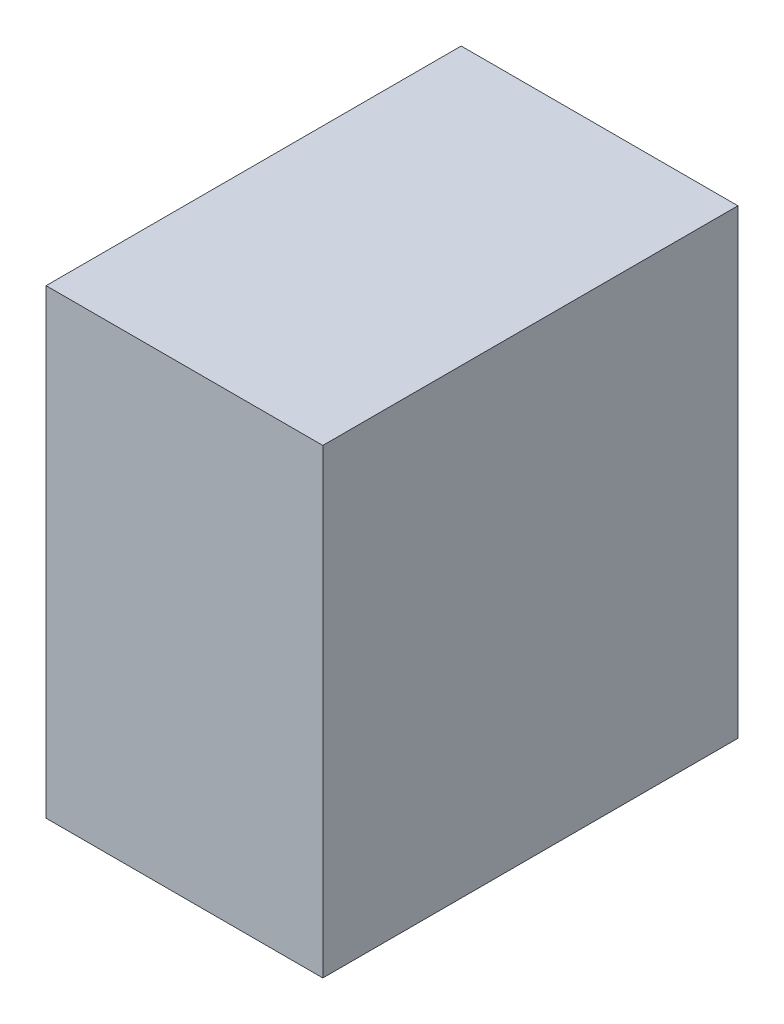
ISO-10303-21;
HEADER;
FILE_DESCRIPTION(('STEP AP214'),'2;1');
FILE_NAME('part.step','',(''),(''),'','','');
FILE_SCHEMA(('AUTOMOTIVE_DESIGN { 1 0 10303 214 1 1 1 1 }'));
ENDSEC;
DATA;
#1=APPLICATION_CONTEXT('core data for automotive mechanical design processes');
#2=APPLICATION_PROTOCOL_DEFINITION('international standard','automotive_design',2000,#1);
#3=PRODUCT_CONTEXT('',#1,'mechanical');
#4=PRODUCT('Part','Part','',(#3));
#5=PRODUCT_RELATED_PRODUCT_CATEGORY('part','',(#4));
#6=PRODUCT_DEFINITION_FORMATION('','',#4);
#7=PRODUCT_DEFINITION_CONTEXT('part definition',#1,'design');
#8=PRODUCT_DEFINITION('design','',#6,#7);
#9=PRODUCT_DEFINITION_SHAPE('','',#8);
#10=(LENGTH_UNIT() NAMED_UNIT(*) SI_UNIT(.MILLI.,.METRE.));
#11=(NAMED_UNIT(*) PLANE_ANGLE_UNIT() SI_UNIT($,.RADIAN.));
#12=(NAMED_UNIT(*) SI_UNIT($,.STERADIAN.) SOLID_ANGLE_UNIT());
#13=UNCERTAINTY_MEASURE_WITH_UNIT(LENGTH_MEASURE(1.E-05),#10,'distance_accuracy_value','');
#14=(GEOMETRIC_REPRESENTATION_CONTEXT(3) GLOBAL_UNCERTAINTY_ASSIGNED_CONTEXT((#13)) GLOBAL_UNIT_ASSIGNED_CONTEXT((#10,
#11,#12)) REPRESENTATION_CONTEXT('',''));
#15=CARTESIAN_POINT('',(0.,0.,0.));
#16=DIRECTION('',(0.,0.,1.));
#17=DIRECTION('',(1.,0.,0.));
#18=AXIS2_PLACEMENT_3D('',#15,#16,#17);
#19=CARTESIAN_POINT('',(-3.30000031472203,-1.79999963719548,-3.30112167835709));
#20=DIRECTION('',(1.,-1.74845553146952E-07,0.));
#21=DIRECTION('',(1.74845553146952E-07,1.,8.74227765734759E-08));
#22=AXIS2_PLACEMENT_3D('',#19,#20,#21);
#23=PLANE('',#22);
#24=DIRECTION('',(0.,-8.74227771655945E-08,0.999999999999996));
#25=VECTOR('',#24,1.);
#26=CARTESIAN_POINT('',(-3.3000001311342,-0.749999641564616,-3.25112158656318));
#27=LINE('',#26,#25);
#28=CARTESIAN_POINT('',(-3.3000001311352,-0.749999641564616,-3.25112158656218));
#29=VERTEX_POINT('',#28);
#30=CARTESIAN_POINT('',(-3.30000013113522,-0.749999720246115,-2.35112158656318));
#31=VERTEX_POINT('',#30);
#32=EDGE_CURVE('E11',#29,#31,#27,.T.);
#33=ORIENTED_EDGE('',*,*,#32,.T.);
#34=DIRECTION('',(-1.74845553146599E-07,-0.999999999999981,-8.74227765732993E-08));
#35=VECTOR('',#34,1.);
#36=CARTESIAN_POINT('',(-3.30000013113422,-0.749999720245115,-2.35112158656318));
#37=LINE('',#36,#35);
#38=CARTESIAN_POINT('',(-3.30000030598077,-1.74999972024712,-2.35112167398695));
#39=VERTEX_POINT('',#38);
#40=EDGE_CURVE('E69',#31,#39,#37,.T.);
#41=ORIENTED_EDGE('',*,*,#40,.T.);
#42=DIRECTION('',(0.,8.7422776672162E-08,-0.999999999999996));
#43=VECTOR('',#42,1.);
#44=CARTESIAN_POINT('',(-3.30000030597977,-1.74999972024711,-2.35112167398595));
#45=LINE('',#44,#43);
#46=CARTESIAN_POINT('',(-3.30000030598076,-1.74999964156562,-3.25112167398595));
#47=VERTEX_POINT('',#46);
#48=EDGE_CURVE('E55',#39,#47,#45,.T.);
#49=ORIENTED_EDGE('',*,*,#48,.T.);
#50=DIRECTION('',(1.74845553146599E-07,0.999999999999981,8.74227765732993E-08));
#51=VECTOR('',#50,1.);
#52=CARTESIAN_POINT('',(-3.30000030597976,-1.74999964156662,-3.25112167398595));
#53=LINE('',#52,#51);
#54=EDGE_CURVE('E53',#47,#29,#53,.T.);
#55=ORIENTED_EDGE('',*,*,#54,.T.);
#56=EDGE_LOOP('',(#33,#41,#49,#55));
#57=FACE_BOUND('',#56,.T.);
#58=ADVANCED_FACE('F17',(#57),#23,.T.);
#59=CARTESIAN_POINT('',(-3.90000031472203,-1.79999953228815,-3.30112167835709));
#60=DIRECTION('',(1.,-1.74845553146952E-07,0.));
#61=DIRECTION('',(1.74845553146952E-07,1.,8.74227765734759E-08));
#62=AXIS2_PLACEMENT_3D('',#59,#60,#61);
#63=PLANE('',#62);
#64=DIRECTION('',(1.74845553146599E-07,0.999999999999981,8.74227765732993E-08));
#65=VECTOR('',#64,1.);
#66=CARTESIAN_POINT('',(-3.90000030597976,-1.74999953665928,-3.25112167398595));
#67=LINE('',#66,#65);
#68=CARTESIAN_POINT('',(-3.90000030597876,-1.74999953665828,-3.25112167398595));
#69=VERTEX_POINT('',#68);
#70=CARTESIAN_POINT('',(-3.9000001311332,-0.749999536657284,-3.25112158656218));
#71=VERTEX_POINT('',#70);
#72=EDGE_CURVE('E24',#69,#71,#67,.T.);
#73=ORIENTED_EDGE('',*,*,#72,.F.);
#74=DIRECTION('',(0.,8.7422776672162E-08,-0.999999999999996));
#75=VECTOR('',#74,1.);
#76=CARTESIAN_POINT('',(-3.90000030597977,-1.74999961533978,-2.35112167398595));
#77=LINE('',#76,#75);
#78=CARTESIAN_POINT('',(-3.90000030597877,-1.74999961533978,-2.35112167398695));
#79=VERTEX_POINT('',#78);
#80=EDGE_CURVE('E70',#79,#69,#77,.T.);
#81=ORIENTED_EDGE('',*,*,#80,.F.);
#82=DIRECTION('',(-1.74845553146599E-07,-0.999999999999981,-8.74227765732994E-08));
#83=VECTOR('',#82,1.);
#84=CARTESIAN_POINT('',(-3.90000013113422,-0.749999615337783,-2.35112158656318));
#85=LINE('',#84,#83);
#86=CARTESIAN_POINT('',(-3.90000013113322,-0.749999615338783,-2.35112158656318));
#87=VERTEX_POINT('',#86);
#88=EDGE_CURVE('E59',#87,#79,#85,.T.);
#89=ORIENTED_EDGE('',*,*,#88,.F.);
#90=DIRECTION('',(0.,-8.74227765488039E-08,0.999999999999996));
#91=VECTOR('',#90,1.);
#92=CARTESIAN_POINT('',(-3.9000001311342,-0.749999536657284,-3.25112158656318));
#93=LINE('',#92,#91);
#94=EDGE_CURVE('E78',#71,#87,#93,.T.);
#95=ORIENTED_EDGE('',*,*,#94,.F.);
#96=EDGE_LOOP('',(#73,#81,#89,#95));
#97=FACE_BOUND('',#96,.T.);
#98=ADVANCED_FACE('F89',(#97),#63,.F.);
#99=CARTESIAN_POINT('',(-3.3000001311342,-0.749999641564616,-3.25112158656318));
#100=DIRECTION('',(-1.74845553146952E-07,-1.,-8.74227765734759E-08));
#101=DIRECTION('',(0.,-8.74227765734759E-08,1.));
#102=AXIS2_PLACEMENT_3D('',#99,#100,#101);
#103=PLANE('',#102);
#104=DIRECTION('',(-0.999999999999985,1.74845553220964E-07,0.));
#105=VECTOR('',#104,1.);
#106=CARTESIAN_POINT('',(-3.3000001311342,-0.749999641564616,-3.25112158656318));
#107=LINE('',#106,#105);
#108=EDGE_CURVE('E65',#29,#71,#107,.T.);
#109=ORIENTED_EDGE('',*,*,#108,.T.);
#110=ORIENTED_EDGE('',*,*,#94,.T.);
#111=DIRECTION('',(-0.999999999999985,1.74845553220964E-07,0.));
#112=VECTOR('',#111,1.);
#113=CARTESIAN_POINT('',(-3.30000013113422,-0.749999720245115,-2.35112158656318));
#114=LINE('',#113,#112);
#115=EDGE_CURVE('E66',#31,#87,#114,.T.);
#116=ORIENTED_EDGE('',*,*,#115,.F.);
#117=ORIENTED_EDGE('',*,*,#32,.F.);
#118=EDGE_LOOP('',(#109,#110,#116,#117));
#119=FACE_BOUND('',#118,.T.);
#120=ADVANCED_FACE('F63',(#119),#103,.F.);
#121=CARTESIAN_POINT('',(-3.30000013113422,-0.749999720245115,-2.35112158656318));
#122=DIRECTION('',(0.,8.74227765734759E-08,-1.));
#123=DIRECTION('',(-1.74845553146952E-07,-1.,-8.74227765734759E-08));
#124=AXIS2_PLACEMENT_3D('',#121,#122,#123);
#125=PLANE('',#124);
#126=ORIENTED_EDGE('',*,*,#115,.T.);
#127=ORIENTED_EDGE('',*,*,#88,.T.);
#128=DIRECTION('',(-0.999999999999985,1.74845553220964E-07,0.));
#129=VECTOR('',#128,1.);
#130=CARTESIAN_POINT('',(-3.30000030597977,-1.74999972024712,-2.35112167398595));
#131=LINE('',#130,#129);
#132=EDGE_CURVE('E60',#39,#79,#131,.T.);
#133=ORIENTED_EDGE('',*,*,#132,.F.);
#134=ORIENTED_EDGE('',*,*,#40,.F.);
#135=EDGE_LOOP('',(#126,#127,#133,#134));
#136=FACE_BOUND('',#135,.T.);
#137=ADVANCED_FACE('F91',(#136),#125,.F.);
#138=CARTESIAN_POINT('',(-3.30000030597977,-1.74999972024712,-2.35112167398595));
#139=DIRECTION('',(1.74845553146952E-07,1.,8.74227765734759E-08));
#140=DIRECTION('',(0.,8.74227765734759E-08,-1.));
#141=AXIS2_PLACEMENT_3D('',#138,#139,#140);
#142=PLANE('',#141);
#143=ORIENTED_EDGE('',*,*,#132,.T.);
#144=ORIENTED_EDGE('',*,*,#80,.T.);
#145=DIRECTION('',(-0.999999999999985,1.74845553220964E-07,0.));
#146=VECTOR('',#145,1.);
#147=CARTESIAN_POINT('',(-3.30000030597976,-1.74999964156662,-3.25112167398595));
#148=LINE('',#147,#146);
#149=EDGE_CURVE('E84',#47,#69,#148,.T.);
#150=ORIENTED_EDGE('',*,*,#149,.F.);
#151=ORIENTED_EDGE('',*,*,#48,.F.);
#152=EDGE_LOOP('',(#143,#144,#150,#151));
#153=FACE_BOUND('',#152,.T.);
#154=ADVANCED_FACE('F86',(#153),#142,.F.);
#155=CARTESIAN_POINT('',(-3.30000030597976,-1.74999964156662,-3.25112167398595));
#156=DIRECTION('',(0.,-8.74227765734759E-08,1.));
#157=DIRECTION('',(1.74845553146952E-07,1.,8.74227765734759E-08));
#158=AXIS2_PLACEMENT_3D('',#155,#156,#157);
#159=PLANE('',#158);
#160=ORIENTED_EDGE('',*,*,#149,.T.);
#161=ORIENTED_EDGE('',*,*,#72,.T.);
#162=ORIENTED_EDGE('',*,*,#108,.F.);
#163=ORIENTED_EDGE('',*,*,#54,.F.);
#164=EDGE_LOOP('',(#160,#161,#162,#163));
#165=FACE_BOUND('',#164,.T.);
#166=ADVANCED_FACE('F68',(#165),#159,.F.);
#167=CLOSED_SHELL('',(#58,#98,#120,#137,#154,#166));
#168=MANIFOLD_SOLID_BREP('B1',#167);
#169=ADVANCED_BREP_SHAPE_REPRESENTATION('',(#18,#168),#14);
#170=SHAPE_DEFINITION_REPRESENTATION(#9,#169);
ENDSEC;
END-ISO-10303-21;
